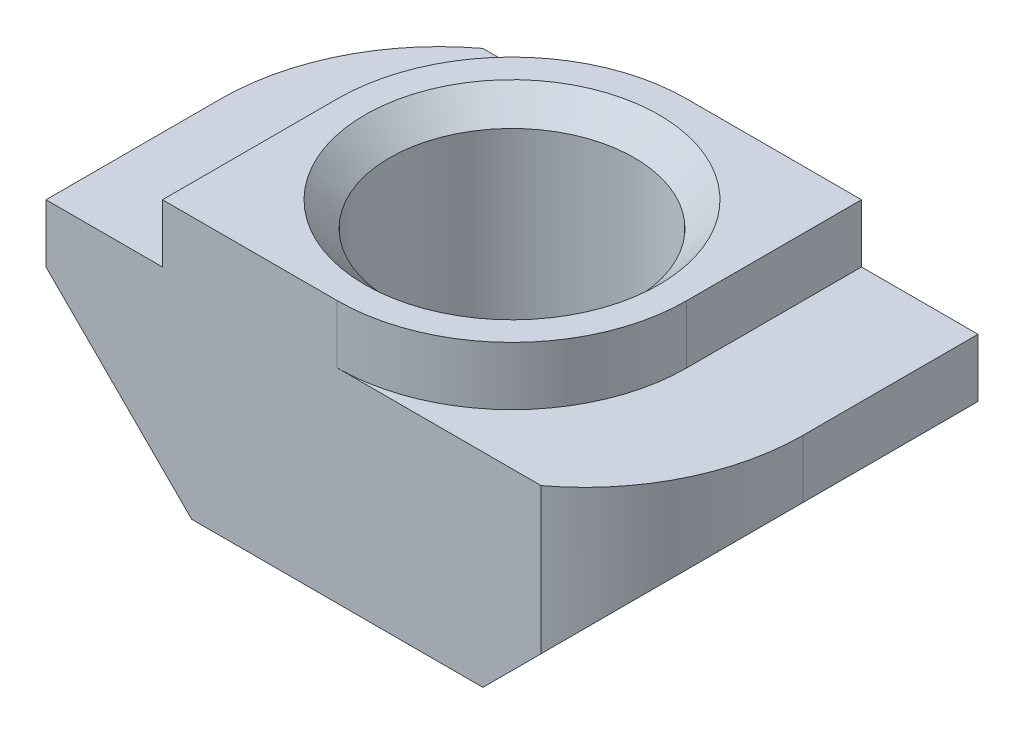
ISO-10303-21;
HEADER;
FILE_DESCRIPTION(('STEP AP214'),'2;1');
FILE_NAME('part.step','',(''),(''),'','','');
FILE_SCHEMA(('AUTOMOTIVE_DESIGN { 1 0 10303 214 1 1 1 1 }'));
ENDSEC;
DATA;
#1=APPLICATION_CONTEXT('core data for automotive mechanical design processes');
#2=APPLICATION_PROTOCOL_DEFINITION('international standard','automotive_design',2000,#1);
#3=PRODUCT_CONTEXT('',#1,'mechanical');
#4=PRODUCT('Part','Part','',(#3));
#5=PRODUCT_RELATED_PRODUCT_CATEGORY('part','',(#4));
#6=PRODUCT_DEFINITION_FORMATION('','',#4);
#7=PRODUCT_DEFINITION_CONTEXT('part definition',#1,'design');
#8=PRODUCT_DEFINITION('design','',#6,#7);
#9=PRODUCT_DEFINITION_SHAPE('','',#8);
#10=(LENGTH_UNIT() NAMED_UNIT(*) SI_UNIT(.MILLI.,.METRE.));
#11=(NAMED_UNIT(*) PLANE_ANGLE_UNIT() SI_UNIT($,.RADIAN.));
#12=(NAMED_UNIT(*) SI_UNIT($,.STERADIAN.) SOLID_ANGLE_UNIT());
#13=UNCERTAINTY_MEASURE_WITH_UNIT(LENGTH_MEASURE(1.E-05),#10,'distance_accuracy_value','');
#14=(GEOMETRIC_REPRESENTATION_CONTEXT(3) GLOBAL_UNCERTAINTY_ASSIGNED_CONTEXT((#13)) GLOBAL_UNIT_ASSIGNED_CONTEXT((#10,
#11,#12)) REPRESENTATION_CONTEXT('',''));
#15=CARTESIAN_POINT('',(0.,0.,0.));
#16=DIRECTION('',(0.,0.,1.));
#17=DIRECTION('',(1.,0.,0.));
#18=AXIS2_PLACEMENT_3D('',#15,#16,#17);
#19=CARTESIAN_POINT('',(-3.,4.5,6.));
#20=DIRECTION('',(0.,-1.,0.));
#21=DIRECTION('',(0.,0.,-1.));
#22=AXIS2_PLACEMENT_3D('',#19,#20,#21);
#23=PLANE('',#22);
#24=CARTESIAN_POINT('',(0.,4.5,3.));
#25=DIRECTION('',(0.,1.,0.));
#26=DIRECTION('',(0.,0.,1.));
#27=AXIS2_PLACEMENT_3D('',#24,#25,#26);
#28=CIRCLE('',#27,2.525);
#29=CARTESIAN_POINT('',(0.,4.5,5.525));
#30=VERTEX_POINT('',#29);
#31=EDGE_CURVE('E253',#30,#30,#28,.T.);
#32=ORIENTED_EDGE('',*,*,#31,.F.);
#33=EDGE_LOOP('',(#32));
#34=FACE_BOUND('',#33,.T.);
#35=DIRECTION('',(-1.,0.,0.));
#36=VECTOR('',#35,1.);
#37=CARTESIAN_POINT('',(-3.,4.5,6.));
#38=LINE('',#37,#36);
#39=CARTESIAN_POINT('',(0.,4.5,6.));
#40=VERTEX_POINT('',#39);
#41=CARTESIAN_POINT('',(-3.,4.5,6.));
#42=VERTEX_POINT('',#41);
#43=EDGE_CURVE('E221',#40,#42,#38,.T.);
#44=ORIENTED_EDGE('',*,*,#43,.F.);
#45=CARTESIAN_POINT('',(0.,4.5,3.));
#46=DIRECTION('',(0.,-1.,0.));
#47=DIRECTION('',(0.,0.,-1.));
#48=AXIS2_PLACEMENT_3D('',#45,#46,#47);
#49=CIRCLE('',#48,3.);
#50=CARTESIAN_POINT('',(3.,4.5,3.));
#51=VERTEX_POINT('',#50);
#52=EDGE_CURVE('E239',#51,#40,#49,.T.);
#53=ORIENTED_EDGE('',*,*,#52,.F.);
#54=DIRECTION('',(0.,0.,-1.));
#55=VECTOR('',#54,1.);
#56=CARTESIAN_POINT('',(3.,4.5,6.));
#57=LINE('',#56,#55);
#58=CARTESIAN_POINT('',(3.,4.5,0.));
#59=VERTEX_POINT('',#58);
#60=EDGE_CURVE('E164',#51,#59,#57,.T.);
#61=ORIENTED_EDGE('',*,*,#60,.T.);
#62=DIRECTION('',(-1.,0.,0.));
#63=VECTOR('',#62,1.);
#64=CARTESIAN_POINT('',(-3.,4.5,0.));
#65=LINE('',#64,#63);
#66=CARTESIAN_POINT('',(0.,4.5,0.));
#67=VERTEX_POINT('',#66);
#68=EDGE_CURVE('E199',#59,#67,#65,.T.);
#69=ORIENTED_EDGE('',*,*,#68,.T.);
#70=CARTESIAN_POINT('',(0.,4.5,3.00000000000001));
#71=DIRECTION('',(0.,-1.,0.));
#72=DIRECTION('',(0.,0.,-1.));
#73=AXIS2_PLACEMENT_3D('',#70,#71,#72);
#74=CIRCLE('',#73,3.00000000000001);
#75=CARTESIAN_POINT('',(-3.,4.5,3.));
#76=VERTEX_POINT('',#75);
#77=EDGE_CURVE('E229',#76,#67,#74,.T.);
#78=ORIENTED_EDGE('',*,*,#77,.F.);
#79=DIRECTION('',(0.,0.,-1.));
#80=VECTOR('',#79,1.);
#81=CARTESIAN_POINT('',(-3.,4.5,6.));
#82=LINE('',#81,#80);
#83=EDGE_CURVE('E168',#42,#76,#82,.T.);
#84=ORIENTED_EDGE('',*,*,#83,.F.);
#85=EDGE_LOOP('',(#44,#53,#61,#69,#78,#84));
#86=FACE_BOUND('',#85,.T.);
#87=ADVANCED_FACE('F42',(#34,#86),#23,.F.);
#88=CARTESIAN_POINT('',(5.,3.5,6.));
#89=DIRECTION('',(-1.,0.,0.));
#90=DIRECTION('',(0.,0.,1.));
#91=AXIS2_PLACEMENT_3D('',#88,#89,#90);
#92=PLANE('',#91);
#93=DIRECTION('',(0.,0.,-1.));
#94=VECTOR('',#93,1.);
#95=CARTESIAN_POINT('',(5.,3.5,6.));
#96=LINE('',#95,#94);
#97=CARTESIAN_POINT('',(5.,3.5,3.));
#98=VERTEX_POINT('',#97);
#99=CARTESIAN_POINT('',(5.,3.5,0.));
#100=VERTEX_POINT('',#99);
#101=EDGE_CURVE('E153',#98,#100,#96,.T.);
#102=ORIENTED_EDGE('',*,*,#101,.F.);
#103=DIRECTION('',(0.,1.,0.));
#104=VECTOR('',#103,1.);
#105=CARTESIAN_POINT('',(5.,0.,3.));
#106=LINE('',#105,#104);
#107=CARTESIAN_POINT('',(5.,2.5,3.));
#108=VERTEX_POINT('',#107);
#109=EDGE_CURVE('E140',#108,#98,#106,.T.);
#110=ORIENTED_EDGE('',*,*,#109,.F.);
#111=DIRECTION('',(0.,0.,-1.));
#112=VECTOR('',#111,1.);
#113=CARTESIAN_POINT('',(5.,2.5,6.));
#114=LINE('',#113,#112);
#115=CARTESIAN_POINT('',(5.,2.5,0.));
#116=VERTEX_POINT('',#115);
#117=EDGE_CURVE('E186',#108,#116,#114,.T.);
#118=ORIENTED_EDGE('',*,*,#117,.T.);
#119=DIRECTION('',(0.,1.,0.));
#120=VECTOR('',#119,1.);
#121=CARTESIAN_POINT('',(5.,3.5,0.));
#122=LINE('',#121,#120);
#123=EDGE_CURVE('E161',#116,#100,#122,.T.);
#124=ORIENTED_EDGE('',*,*,#123,.T.);
#125=EDGE_LOOP('',(#102,#110,#118,#124));
#126=FACE_BOUND('',#125,.T.);
#127=ADVANCED_FACE('F44',(#126),#92,.F.);
#128=CARTESIAN_POINT('',(3.,3.5,6.));
#129=DIRECTION('',(0.,-1.,0.));
#130=DIRECTION('',(0.,0.,-1.));
#131=AXIS2_PLACEMENT_3D('',#128,#129,#130);
#132=PLANE('',#131);
#133=DIRECTION('',(-1.,0.,0.));
#134=VECTOR('',#133,1.);
#135=CARTESIAN_POINT('',(3.,3.5,6.));
#136=LINE('',#135,#134);
#137=CARTESIAN_POINT('',(3.5,3.5,6.));
#138=VERTEX_POINT('',#137);
#139=CARTESIAN_POINT('',(0.,3.5,6.));
#140=VERTEX_POINT('',#139);
#141=EDGE_CURVE('E156',#138,#140,#136,.T.);
#142=ORIENTED_EDGE('',*,*,#141,.F.);
#143=CARTESIAN_POINT('',(1.25,3.5,3.));
#144=DIRECTION('',(0.,-1.,0.));
#145=DIRECTION('',(0.,0.,-1.));
#146=AXIS2_PLACEMENT_3D('',#143,#144,#145);
#147=CIRCLE('',#146,3.75);
#148=EDGE_CURVE('E57',#98,#138,#147,.T.);
#149=ORIENTED_EDGE('',*,*,#148,.F.);
#150=ORIENTED_EDGE('',*,*,#101,.T.);
#151=DIRECTION('',(-1.,0.,0.));
#152=VECTOR('',#151,1.);
#153=CARTESIAN_POINT('',(3.,3.5,0.));
#154=LINE('',#153,#152);
#155=CARTESIAN_POINT('',(3.,3.5,0.));
#156=VERTEX_POINT('',#155);
#157=EDGE_CURVE('E205',#100,#156,#154,.T.);
#158=ORIENTED_EDGE('',*,*,#157,.T.);
#159=DIRECTION('',(0.,0.,-1.));
#160=VECTOR('',#159,1.);
#161=CARTESIAN_POINT('',(3.,3.5,6.));
#162=LINE('',#161,#160);
#163=CARTESIAN_POINT('',(3.,3.5,3.));
#164=VERTEX_POINT('',#163);
#165=EDGE_CURVE('E162',#164,#156,#162,.T.);
#166=ORIENTED_EDGE('',*,*,#165,.F.);
#167=CARTESIAN_POINT('',(0.,3.5,3.));
#168=DIRECTION('',(0.,-1.,0.));
#169=DIRECTION('',(0.,0.,-1.));
#170=AXIS2_PLACEMENT_3D('',#167,#168,#169);
#171=CIRCLE('',#170,3.);
#172=EDGE_CURVE('E236',#164,#140,#171,.T.);
#173=ORIENTED_EDGE('',*,*,#172,.T.);
#174=EDGE_LOOP('',(#142,#149,#150,#158,#166,#173));
#175=FACE_BOUND('',#174,.T.);
#176=ADVANCED_FACE('F151',(#175),#132,.F.);
#177=CARTESIAN_POINT('',(3.,4.5,6.));
#178=DIRECTION('',(-1.,0.,0.));
#179=DIRECTION('',(0.,0.,1.));
#180=AXIS2_PLACEMENT_3D('',#177,#178,#179);
#181=PLANE('',#180);
#182=ORIENTED_EDGE('',*,*,#60,.F.);
#183=DIRECTION('',(0.,1.,0.));
#184=VECTOR('',#183,1.);
#185=CARTESIAN_POINT('',(3.,-0.742640687119286,3.));
#186=LINE('',#185,#184);
#187=EDGE_CURVE('E237',#164,#51,#186,.T.);
#188=ORIENTED_EDGE('',*,*,#187,.F.);
#189=ORIENTED_EDGE('',*,*,#165,.T.);
#190=DIRECTION('',(0.,1.,0.));
#191=VECTOR('',#190,1.);
#192=CARTESIAN_POINT('',(3.,4.5,0.));
#193=LINE('',#192,#191);
#194=EDGE_CURVE('E202',#156,#59,#193,.T.);
#195=ORIENTED_EDGE('',*,*,#194,.T.);
#196=EDGE_LOOP('',(#182,#188,#189,#195));
#197=FACE_BOUND('',#196,.T.);
#198=ADVANCED_FACE('F277',(#197),#181,.F.);
#199=CARTESIAN_POINT('',(-3.,4.5,6.));
#200=DIRECTION('',(1.,0.,0.));
#201=DIRECTION('',(0.,0.,-1.));
#202=AXIS2_PLACEMENT_3D('',#199,#200,#201);
#203=PLANE('',#202);
#204=ORIENTED_EDGE('',*,*,#83,.T.);
#205=DIRECTION('',(0.,1.,0.));
#206=VECTOR('',#205,1.);
#207=CARTESIAN_POINT('',(-3.,-0.742640687119286,3.));
#208=LINE('',#207,#206);
#209=CARTESIAN_POINT('',(-3.,3.5,3.));
#210=VERTEX_POINT('',#209);
#211=EDGE_CURVE('E227',#210,#76,#208,.T.);
#212=ORIENTED_EDGE('',*,*,#211,.F.);
#213=DIRECTION('',(0.,0.,-1.));
#214=VECTOR('',#213,1.);
#215=CARTESIAN_POINT('',(-3.,3.5,6.));
#216=LINE('',#215,#214);
#217=CARTESIAN_POINT('',(-3.,3.5,6.));
#218=VERTEX_POINT('',#217);
#219=EDGE_CURVE('E171',#218,#210,#216,.T.);
#220=ORIENTED_EDGE('',*,*,#219,.F.);
#221=DIRECTION('',(0.,-1.,0.));
#222=VECTOR('',#221,1.);
#223=CARTESIAN_POINT('',(-3.,4.5,6.));
#224=LINE('',#223,#222);
#225=EDGE_CURVE('E219',#42,#218,#224,.T.);
#226=ORIENTED_EDGE('',*,*,#225,.F.);
#227=EDGE_LOOP('',(#204,#212,#220,#226));
#228=FACE_BOUND('',#227,.T.);
#229=ADVANCED_FACE('F286',(#228),#203,.F.);
#230=CARTESIAN_POINT('',(-3.,3.5,6.));
#231=DIRECTION('',(0.,-1.,0.));
#232=DIRECTION('',(0.,0.,-1.));
#233=AXIS2_PLACEMENT_3D('',#230,#231,#232);
#234=PLANE('',#233);
#235=DIRECTION('',(-1.,0.,0.));
#236=VECTOR('',#235,1.);
#237=CARTESIAN_POINT('',(-3.,3.5,0.));
#238=LINE('',#237,#236);
#239=CARTESIAN_POINT('',(0.,3.5,0.));
#240=VERTEX_POINT('',#239);
#241=CARTESIAN_POINT('',(-3.49999999999998,3.5,0.));
#242=VERTEX_POINT('',#241);
#243=EDGE_CURVE('E196',#240,#242,#238,.T.);
#244=ORIENTED_EDGE('',*,*,#243,.T.);
#245=CARTESIAN_POINT('',(-1.25,3.5,2.99999999999999));
#246=DIRECTION('',(0.,-1.,0.));
#247=DIRECTION('',(0.,0.,-1.));
#248=AXIS2_PLACEMENT_3D('',#245,#246,#247);
#249=CIRCLE('',#248,3.75);
#250=CARTESIAN_POINT('',(-5.,3.5,2.99999999999997));
#251=VERTEX_POINT('',#250);
#252=EDGE_CURVE('E64',#251,#242,#249,.T.);
#253=ORIENTED_EDGE('',*,*,#252,.F.);
#254=DIRECTION('',(0.,0.,-1.));
#255=VECTOR('',#254,1.);
#256=CARTESIAN_POINT('',(-5.,3.5,6.));
#257=LINE('',#256,#255);
#258=CARTESIAN_POINT('',(-5.,3.5,6.));
#259=VERTEX_POINT('',#258);
#260=EDGE_CURVE('E174',#259,#251,#257,.T.);
#261=ORIENTED_EDGE('',*,*,#260,.F.);
#262=DIRECTION('',(-1.,0.,0.));
#263=VECTOR('',#262,1.);
#264=CARTESIAN_POINT('',(-3.,3.5,6.));
#265=LINE('',#264,#263);
#266=EDGE_CURVE('E217',#218,#259,#265,.T.);
#267=ORIENTED_EDGE('',*,*,#266,.F.);
#268=ORIENTED_EDGE('',*,*,#219,.T.);
#269=CARTESIAN_POINT('',(0.,3.5,3.00000000000001));
#270=DIRECTION('',(0.,-1.,0.));
#271=DIRECTION('',(0.,0.,-1.));
#272=AXIS2_PLACEMENT_3D('',#269,#270,#271);
#273=CIRCLE('',#272,3.00000000000001);
#274=EDGE_CURVE('E226',#210,#240,#273,.T.);
#275=ORIENTED_EDGE('',*,*,#274,.T.);
#276=EDGE_LOOP('',(#244,#253,#261,#267,#268,#275));
#277=FACE_BOUND('',#276,.T.);
#278=ADVANCED_FACE('F290',(#277),#234,.F.);
#279=CARTESIAN_POINT('',(-5.,3.5,6.));
#280=DIRECTION('',(1.,0.,0.));
#281=DIRECTION('',(0.,0.,-1.));
#282=AXIS2_PLACEMENT_3D('',#279,#280,#281);
#283=PLANE('',#282);
#284=ORIENTED_EDGE('',*,*,#260,.T.);
#285=DIRECTION('',(0.,1.,0.));
#286=VECTOR('',#285,1.);
#287=CARTESIAN_POINT('',(-5.,0.,2.99999999999997));
#288=LINE('',#287,#286);
#289=CARTESIAN_POINT('',(-5.,2.49999999999999,2.99999999999997));
#290=VERTEX_POINT('',#289);
#291=EDGE_CURVE('E157',#290,#251,#288,.T.);
#292=ORIENTED_EDGE('',*,*,#291,.F.);
#293=DIRECTION('',(0.,0.,-1.));
#294=VECTOR('',#293,1.);
#295=CARTESIAN_POINT('',(-5.,2.5,6.));
#296=LINE('',#295,#294);
#297=CARTESIAN_POINT('',(-5.,2.5,6.));
#298=VERTEX_POINT('',#297);
#299=EDGE_CURVE('E177',#298,#290,#296,.T.);
#300=ORIENTED_EDGE('',*,*,#299,.F.);
#301=DIRECTION('',(0.,-1.,0.));
#302=VECTOR('',#301,1.);
#303=CARTESIAN_POINT('',(-5.,3.5,6.));
#304=LINE('',#303,#302);
#305=EDGE_CURVE('E215',#259,#298,#304,.T.);
#306=ORIENTED_EDGE('',*,*,#305,.F.);
#307=EDGE_LOOP('',(#284,#292,#300,#306));
#308=FACE_BOUND('',#307,.T.);
#309=ADVANCED_FACE('F297',(#308),#283,.F.);
#310=CARTESIAN_POINT('',(-5.,2.5,6.));
#311=DIRECTION('',(0.707106781186549,0.707106781186546,0.));
#312=DIRECTION('',(-0.707106781186546,0.707106781186549,0.));
#313=AXIS2_PLACEMENT_3D('',#310,#311,#312);
#314=PLANE('',#313);
#315=ORIENTED_EDGE('',*,*,#299,.T.);
#316=CARTESIAN_POINT('',(-1.25,-1.25000000000002,2.99999999999999));
#317=DIRECTION('',(0.707106781186549,0.707106781186546,0.));
#318=DIRECTION('',(-0.707106781186546,0.707106781186549,0.));
#319=AXIS2_PLACEMENT_3D('',#316,#317,#318);
#320=ELLIPSE('',#319,5.30330085889912,3.75);
#321=CARTESIAN_POINT('',(-3.49999999999998,1.,0.));
#322=VERTEX_POINT('',#321);
#323=EDGE_CURVE('E147',#290,#322,#320,.F.);
#324=ORIENTED_EDGE('',*,*,#323,.T.);
#325=DIRECTION('',(0.707106781186546,-0.707106781186549,0.));
#326=VECTOR('',#325,1.);
#327=CARTESIAN_POINT('',(-5.,2.5,0.));
#328=LINE('',#327,#326);
#329=CARTESIAN_POINT('',(-2.50000000000001,0.,0.));
#330=VERTEX_POINT('',#329);
#331=EDGE_CURVE('E194',#322,#330,#328,.T.);
#332=ORIENTED_EDGE('',*,*,#331,.T.);
#333=DIRECTION('',(0.,0.,-1.));
#334=VECTOR('',#333,1.);
#335=CARTESIAN_POINT('',(-2.50000000000001,0.,6.));
#336=LINE('',#335,#334);
#337=CARTESIAN_POINT('',(-2.50000000000001,0.,6.));
#338=VERTEX_POINT('',#337);
#339=EDGE_CURVE('E180',#338,#330,#336,.T.);
#340=ORIENTED_EDGE('',*,*,#339,.F.);
#341=DIRECTION('',(0.707106781186546,-0.707106781186549,0.));
#342=VECTOR('',#341,1.);
#343=CARTESIAN_POINT('',(-5.,2.5,6.));
#344=LINE('',#343,#342);
#345=EDGE_CURVE('E213',#298,#338,#344,.T.);
#346=ORIENTED_EDGE('',*,*,#345,.F.);
#347=EDGE_LOOP('',(#315,#324,#332,#340,#346));
#348=FACE_BOUND('',#347,.T.);
#349=ADVANCED_FACE('F299',(#348),#314,.F.);
#350=CARTESIAN_POINT('',(2.50000000000001,0.,6.));
#351=DIRECTION('',(0.,1.,0.));
#352=DIRECTION('',(0.,0.,1.));
#353=AXIS2_PLACEMENT_3D('',#350,#351,#352);
#354=PLANE('',#353);
#355=CARTESIAN_POINT('',(0.,0.,3.));
#356=DIRECTION('',(0.,1.,0.));
#357=DIRECTION('',(0.,0.,1.));
#358=AXIS2_PLACEMENT_3D('',#355,#356,#357);
#359=CIRCLE('',#358,2.1);
#360=CARTESIAN_POINT('',(0.,0.,5.1));
#361=VERTEX_POINT('',#360);
#362=EDGE_CURVE('E246',#361,#361,#359,.T.);
#363=ORIENTED_EDGE('',*,*,#362,.T.);
#364=EDGE_LOOP('',(#363));
#365=FACE_BOUND('',#364,.T.);
#366=DIRECTION('',(1.,0.,0.));
#367=VECTOR('',#366,1.);
#368=CARTESIAN_POINT('',(2.50000000000001,0.,0.));
#369=LINE('',#368,#367);
#370=CARTESIAN_POINT('',(2.50000000000001,0.,0.));
#371=VERTEX_POINT('',#370);
#372=EDGE_CURVE('E192',#330,#371,#369,.T.);
#373=ORIENTED_EDGE('',*,*,#372,.T.);
#374=DIRECTION('',(0.,0.,-1.));
#375=VECTOR('',#374,1.);
#376=CARTESIAN_POINT('',(2.50000000000001,0.,6.));
#377=LINE('',#376,#375);
#378=CARTESIAN_POINT('',(2.50000000000001,0.,6.));
#379=VERTEX_POINT('',#378);
#380=EDGE_CURVE('E183',#379,#371,#377,.T.);
#381=ORIENTED_EDGE('',*,*,#380,.F.);
#382=DIRECTION('',(1.,0.,0.));
#383=VECTOR('',#382,1.);
#384=CARTESIAN_POINT('',(2.50000000000001,0.,6.));
#385=LINE('',#384,#383);
#386=EDGE_CURVE('E211',#338,#379,#385,.T.);
#387=ORIENTED_EDGE('',*,*,#386,.F.);
#388=ORIENTED_EDGE('',*,*,#339,.T.);
#389=EDGE_LOOP('',(#373,#381,#387,#388));
#390=FACE_BOUND('',#389,.T.);
#391=ADVANCED_FACE('F305',(#365,#390),#354,.F.);
#392=CARTESIAN_POINT('',(5.,2.5,6.));
#393=DIRECTION('',(-0.707106781186549,0.707106781186546,0.));
#394=DIRECTION('',(-0.707106781186546,-0.707106781186549,0.));
#395=AXIS2_PLACEMENT_3D('',#392,#393,#394);
#396=PLANE('',#395);
#397=ORIENTED_EDGE('',*,*,#117,.F.);
#398=CARTESIAN_POINT('',(1.25,-1.25000000000002,3.));
#399=DIRECTION('',(-0.707106781186549,0.707106781186546,0.));
#400=DIRECTION('',(0.707106781186546,0.707106781186549,0.));
#401=AXIS2_PLACEMENT_3D('',#398,#399,#400);
#402=ELLIPSE('',#401,5.30330085889912,3.75);
#403=CARTESIAN_POINT('',(3.5,0.999999999999991,6.));
#404=VERTEX_POINT('',#403);
#405=EDGE_CURVE('E143',#108,#404,#402,.F.);
#406=ORIENTED_EDGE('',*,*,#405,.T.);
#407=DIRECTION('',(0.707106781186546,0.707106781186549,0.));
#408=VECTOR('',#407,1.);
#409=CARTESIAN_POINT('',(5.,2.5,6.));
#410=LINE('',#409,#408);
#411=EDGE_CURVE('E188',#379,#404,#410,.T.);
#412=ORIENTED_EDGE('',*,*,#411,.F.);
#413=ORIENTED_EDGE('',*,*,#380,.T.);
#414=DIRECTION('',(0.707106781186546,0.707106781186549,0.));
#415=VECTOR('',#414,1.);
#416=CARTESIAN_POINT('',(5.,2.5,0.));
#417=LINE('',#416,#415);
#418=EDGE_CURVE('E189',#371,#116,#417,.T.);
#419=ORIENTED_EDGE('',*,*,#418,.T.);
#420=EDGE_LOOP('',(#397,#406,#412,#413,#419));
#421=FACE_BOUND('',#420,.T.);
#422=ADVANCED_FACE('F308',(#421),#396,.F.);
#423=CARTESIAN_POINT('',(0.,0.,6.));
#424=DIRECTION('',(0.,0.,-1.));
#425=DIRECTION('',(-1.,0.,0.));
#426=AXIS2_PLACEMENT_3D('',#423,#424,#425);
#427=PLANE('',#426);
#428=ORIENTED_EDGE('',*,*,#411,.T.);
#429=DIRECTION('',(0.,1.,0.));
#430=VECTOR('',#429,1.);
#431=CARTESIAN_POINT('',(3.5,0.,6.));
#432=LINE('',#431,#430);
#433=EDGE_CURVE('E11',#404,#138,#432,.T.);
#434=ORIENTED_EDGE('',*,*,#433,.T.);
#435=ORIENTED_EDGE('',*,*,#141,.T.);
#436=DIRECTION('',(0.,1.,0.));
#437=VECTOR('',#436,1.);
#438=CARTESIAN_POINT('',(0.,-0.742640687119286,6.));
#439=LINE('',#438,#437);
#440=EDGE_CURVE('E233',#140,#40,#439,.T.);
#441=ORIENTED_EDGE('',*,*,#440,.T.);
#442=ORIENTED_EDGE('',*,*,#43,.T.);
#443=ORIENTED_EDGE('',*,*,#225,.T.);
#444=ORIENTED_EDGE('',*,*,#266,.T.);
#445=ORIENTED_EDGE('',*,*,#305,.T.);
#446=ORIENTED_EDGE('',*,*,#345,.T.);
#447=ORIENTED_EDGE('',*,*,#386,.T.);
#448=EDGE_LOOP('',(#428,#434,#435,#441,#442,#443,#444,#445,#446,#447));
#449=FACE_BOUND('',#448,.T.);
#450=ADVANCED_FACE('F269',(#449),#427,.F.);
#451=CARTESIAN_POINT('',(0.,0.,0.));
#452=DIRECTION('',(0.,0.,-1.));
#453=DIRECTION('',(-1.,0.,0.));
#454=AXIS2_PLACEMENT_3D('',#451,#452,#453);
#455=PLANE('',#454);
#456=DIRECTION('',(0.,1.,0.));
#457=VECTOR('',#456,1.);
#458=CARTESIAN_POINT('',(-3.50000000000001,0.,0.));
#459=LINE('',#458,#457);
#460=EDGE_CURVE('E50',#242,#322,#459,.F.);
#461=ORIENTED_EDGE('',*,*,#460,.F.);
#462=ORIENTED_EDGE('',*,*,#243,.F.);
#463=DIRECTION('',(0.,1.,0.));
#464=VECTOR('',#463,1.);
#465=CARTESIAN_POINT('',(0.,-0.742640687119286,0.));
#466=LINE('',#465,#464);
#467=EDGE_CURVE('E208',#240,#67,#466,.T.);
#468=ORIENTED_EDGE('',*,*,#467,.T.);
#469=ORIENTED_EDGE('',*,*,#68,.F.);
#470=ORIENTED_EDGE('',*,*,#194,.F.);
#471=ORIENTED_EDGE('',*,*,#157,.F.);
#472=ORIENTED_EDGE('',*,*,#123,.F.);
#473=ORIENTED_EDGE('',*,*,#418,.F.);
#474=ORIENTED_EDGE('',*,*,#372,.F.);
#475=ORIENTED_EDGE('',*,*,#331,.F.);
#476=EDGE_LOOP('',(#461,#462,#468,#469,#470,#471,#472,#473,#474,#475));
#477=FACE_BOUND('',#476,.T.);
#478=ADVANCED_FACE('F281',(#477),#455,.T.);
#479=CARTESIAN_POINT('',(0.,-0.742640687119286,3.00000000000001));
#480=DIRECTION('',(0.,1.,0.));
#481=DIRECTION('',(0.,0.,1.));
#482=AXIS2_PLACEMENT_3D('',#479,#480,#481);
#483=CYLINDRICAL_SURFACE('',#482,3.00000000000001);
#484=ORIENTED_EDGE('',*,*,#211,.T.);
#485=ORIENTED_EDGE('',*,*,#77,.T.);
#486=ORIENTED_EDGE('',*,*,#467,.F.);
#487=ORIENTED_EDGE('',*,*,#274,.F.);
#488=EDGE_LOOP('',(#484,#485,#486,#487));
#489=FACE_BOUND('',#488,.T.);
#490=ADVANCED_FACE('F310',(#489),#483,.T.);
#491=CARTESIAN_POINT('',(0.,-0.742640687119286,3.));
#492=DIRECTION('',(0.,1.,0.));
#493=DIRECTION('',(0.,0.,1.));
#494=AXIS2_PLACEMENT_3D('',#491,#492,#493);
#495=CYLINDRICAL_SURFACE('',#494,3.);
#496=ORIENTED_EDGE('',*,*,#187,.T.);
#497=ORIENTED_EDGE('',*,*,#52,.T.);
#498=ORIENTED_EDGE('',*,*,#440,.F.);
#499=ORIENTED_EDGE('',*,*,#172,.F.);
#500=EDGE_LOOP('',(#496,#497,#498,#499));
#501=FACE_BOUND('',#500,.T.);
#502=ADVANCED_FACE('F273',(#501),#495,.T.);
#503=CARTESIAN_POINT('',(-1.25,0.,2.99999999999999));
#504=DIRECTION('',(0.,1.,0.));
#505=DIRECTION('',(0.,0.,1.));
#506=AXIS2_PLACEMENT_3D('',#503,#504,#505);
#507=CYLINDRICAL_SURFACE('',#506,3.75);
#508=ORIENTED_EDGE('',*,*,#291,.T.);
#509=ORIENTED_EDGE('',*,*,#252,.T.);
#510=ORIENTED_EDGE('',*,*,#460,.T.);
#511=ORIENTED_EDGE('',*,*,#323,.F.);
#512=EDGE_LOOP('',(#508,#509,#510,#511));
#513=FACE_BOUND('',#512,.T.);
#514=ADVANCED_FACE('F317',(#513),#507,.T.);
#515=CARTESIAN_POINT('',(1.25,0.,3.));
#516=DIRECTION('',(0.,1.,0.));
#517=DIRECTION('',(0.,0.,1.));
#518=AXIS2_PLACEMENT_3D('',#515,#516,#517);
#519=CYLINDRICAL_SURFACE('',#518,3.75);
#520=ORIENTED_EDGE('',*,*,#109,.T.);
#521=ORIENTED_EDGE('',*,*,#148,.T.);
#522=ORIENTED_EDGE('',*,*,#433,.F.);
#523=ORIENTED_EDGE('',*,*,#405,.F.);
#524=EDGE_LOOP('',(#520,#521,#522,#523));
#525=FACE_BOUND('',#524,.T.);
#526=ADVANCED_FACE('F141',(#525),#519,.T.);
#527=CARTESIAN_POINT('',(0.,4.5,3.));
#528=DIRECTION('',(0.,1.,0.));
#529=DIRECTION('',(0.,0.,1.));
#530=AXIS2_PLACEMENT_3D('',#527,#528,#529);
#531=CYLINDRICAL_SURFACE('',#530,2.1);
#532=ORIENTED_EDGE('',*,*,#362,.F.);
#533=EDGE_LOOP('',(#532));
#534=FACE_BOUND('',#533,.T.);
#535=CARTESIAN_POINT('',(0.,4.075,3.));
#536=DIRECTION('',(0.,1.,0.));
#537=DIRECTION('',(0.,0.,1.));
#538=AXIS2_PLACEMENT_3D('',#535,#536,#537);
#539=CIRCLE('',#538,2.1);
#540=CARTESIAN_POINT('',(0.,4.075,5.1));
#541=VERTEX_POINT('',#540);
#542=EDGE_CURVE('E250',#541,#541,#539,.T.);
#543=ORIENTED_EDGE('',*,*,#542,.T.);
#544=EDGE_LOOP('',(#543));
#545=FACE_BOUND('',#544,.T.);
#546=ADVANCED_FACE('F369',(#534,#545),#531,.F.);
#547=CARTESIAN_POINT('',(0.,4.5,3.));
#548=DIRECTION('',(0.,1.,0.));
#549=DIRECTION('',(0.,0.,1.));
#550=AXIS2_PLACEMENT_3D('',#547,#548,#549);
#551=CONICAL_SURFACE('',#550,2.525,0.785398163397449);
#552=ORIENTED_EDGE('',*,*,#542,.F.);
#553=EDGE_LOOP('',(#552));
#554=FACE_BOUND('',#553,.T.);
#555=ORIENTED_EDGE('',*,*,#31,.T.);
#556=EDGE_LOOP('',(#555));
#557=FACE_BOUND('',#556,.T.);
#558=ADVANCED_FACE('F257',(#554,#557),#551,.F.);
#559=CLOSED_SHELL('',(#87,#127,#176,#198,#229,#278,#309,#349,#391,#422,#450,#478,#490,#502,#514,
#526,#546,#558));
#560=MANIFOLD_SOLID_BREP('B2',#559);
#561=ADVANCED_BREP_SHAPE_REPRESENTATION('',(#18,#560),#14);
#562=SHAPE_DEFINITION_REPRESENTATION(#9,#561);
ENDSEC;
END-ISO-10303-21;
